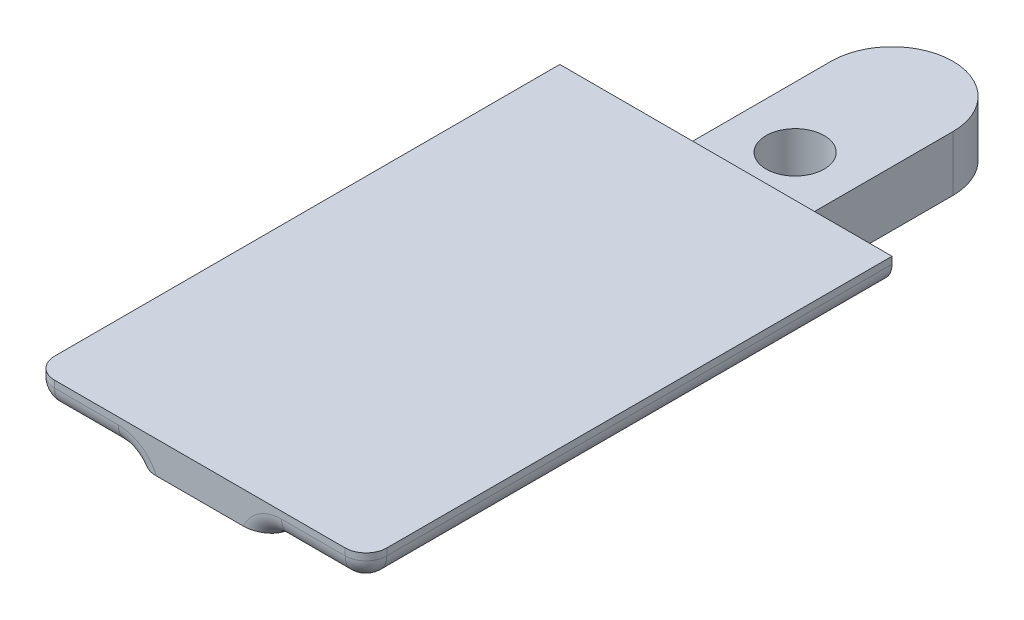
ISO-10303-21;
HEADER;
FILE_DESCRIPTION(('STEP AP214'),'2;1');
FILE_NAME('part.step','',(''),(''),'','','');
FILE_SCHEMA(('AUTOMOTIVE_DESIGN { 1 0 10303 214 1 1 1 1 }'));
ENDSEC;
DATA;
#1=APPLICATION_CONTEXT('core data for automotive mechanical design processes');
#2=APPLICATION_PROTOCOL_DEFINITION('international standard','automotive_design',2000,#1);
#3=PRODUCT_CONTEXT('',#1,'mechanical');
#4=PRODUCT('Part','Part','',(#3));
#5=PRODUCT_RELATED_PRODUCT_CATEGORY('part','',(#4));
#6=PRODUCT_DEFINITION_FORMATION('','',#4);
#7=PRODUCT_DEFINITION_CONTEXT('part definition',#1,'design');
#8=PRODUCT_DEFINITION('design','',#6,#7);
#9=PRODUCT_DEFINITION_SHAPE('','',#8);
#10=(LENGTH_UNIT() NAMED_UNIT(*) SI_UNIT(.MILLI.,.METRE.));
#11=(NAMED_UNIT(*) PLANE_ANGLE_UNIT() SI_UNIT($,.RADIAN.));
#12=(NAMED_UNIT(*) SI_UNIT($,.STERADIAN.) SOLID_ANGLE_UNIT());
#13=UNCERTAINTY_MEASURE_WITH_UNIT(LENGTH_MEASURE(1.E-05),#10,'distance_accuracy_value','');
#14=(GEOMETRIC_REPRESENTATION_CONTEXT(3) GLOBAL_UNCERTAINTY_ASSIGNED_CONTEXT((#13)) GLOBAL_UNIT_ASSIGNED_CONTEXT((#10,
#11,#12)) REPRESENTATION_CONTEXT('',''));
#15=CARTESIAN_POINT('',(0.,0.,0.));
#16=DIRECTION('',(0.,0.,1.));
#17=DIRECTION('',(1.,0.,0.));
#18=AXIS2_PLACEMENT_3D('',#15,#16,#17);
#19=CARTESIAN_POINT('',(0.,4.,-12.));
#20=DIRECTION('',(0.,1.,0.));
#21=DIRECTION('',(0.,0.,1.));
#22=AXIS2_PLACEMENT_3D('',#19,#20,#21);
#23=PLANE('',#22);
#24=DIRECTION('',(-1.,0.,0.));
#25=VECTOR('',#24,1.);
#26=CARTESIAN_POINT('',(-12.,4.,0.));
#27=LINE('',#26,#25);
#28=CARTESIAN_POINT('',(4.4,4.,0.));
#29=VERTEX_POINT('',#28);
#30=CARTESIAN_POINT('',(-4.4,4.,0.));
#31=VERTEX_POINT('',#30);
#32=EDGE_CURVE('E198',#29,#31,#27,.T.);
#33=ORIENTED_EDGE('',*,*,#32,.F.);
#34=DIRECTION('',(0.,0.,-1.));
#35=VECTOR('',#34,1.);
#36=CARTESIAN_POINT('',(4.4,4.,38.));
#37=LINE('',#36,#35);
#38=CARTESIAN_POINT('',(4.4,4.,-12.));
#39=VERTEX_POINT('',#38);
#40=EDGE_CURVE('E209',#29,#39,#37,.T.);
#41=ORIENTED_EDGE('',*,*,#40,.T.);
#42=CARTESIAN_POINT('',(0.,4.,-12.));
#43=DIRECTION('',(0.,1.,0.));
#44=DIRECTION('',(0.,0.,1.));
#45=AXIS2_PLACEMENT_3D('',#42,#43,#44);
#46=CIRCLE('',#45,4.4);
#47=CARTESIAN_POINT('',(-4.4,4.,-12.));
#48=VERTEX_POINT('',#47);
#49=EDGE_CURVE('E212',#39,#48,#46,.T.);
#50=ORIENTED_EDGE('',*,*,#49,.T.);
#51=DIRECTION('',(0.,0.,1.));
#52=VECTOR('',#51,1.);
#53=CARTESIAN_POINT('',(-4.4,4.,0.));
#54=LINE('',#53,#52);
#55=EDGE_CURVE('E206',#48,#31,#54,.T.);
#56=ORIENTED_EDGE('',*,*,#55,.T.);
#57=EDGE_LOOP('',(#33,#41,#50,#56));
#58=FACE_BOUND('',#57,.T.);
#59=CARTESIAN_POINT('',(0.,4.,-5.));
#60=DIRECTION('',(0.,1.,0.));
#61=DIRECTION('',(0.,0.,1.));
#62=AXIS2_PLACEMENT_3D('',#59,#60,#61);
#63=CIRCLE('',#62,2.1);
#64=CARTESIAN_POINT('',(0.,4.,-2.9));
#65=VERTEX_POINT('',#64);
#66=EDGE_CURVE('E200',#65,#65,#63,.T.);
#67=ORIENTED_EDGE('',*,*,#66,.F.);
#68=EDGE_LOOP('',(#67));
#69=FACE_BOUND('',#68,.T.);
#70=ADVANCED_FACE('F37',(#58,#69),#23,.T.);
#71=CARTESIAN_POINT('',(0.,0.,-12.));
#72=DIRECTION('',(0.,1.,0.));
#73=DIRECTION('',(0.,0.,1.));
#74=AXIS2_PLACEMENT_3D('',#71,#72,#73);
#75=PLANE('',#74);
#76=DIRECTION('',(0.,0.,-1.));
#77=VECTOR('',#76,1.);
#78=CARTESIAN_POINT('',(4.4,0.,0.));
#79=LINE('',#78,#77);
#80=CARTESIAN_POINT('',(4.4,0.,7.99999999999916));
#81=VERTEX_POINT('',#80);
#82=CARTESIAN_POINT('',(4.4,0.,-12.));
#83=VERTEX_POINT('',#82);
#84=EDGE_CURVE('E203',#81,#83,#79,.T.);
#85=ORIENTED_EDGE('',*,*,#84,.F.);
#86=DIRECTION('',(-1.,0.,0.));
#87=VECTOR('',#86,1.);
#88=CARTESIAN_POINT('',(0.,0.,7.99999999999916));
#89=LINE('',#88,#87);
#90=CARTESIAN_POINT('',(-4.4,0.,7.99999999999916));
#91=VERTEX_POINT('',#90);
#92=EDGE_CURVE('E231',#81,#91,#89,.T.);
#93=ORIENTED_EDGE('',*,*,#92,.T.);
#94=DIRECTION('',(0.,0.,1.));
#95=VECTOR('',#94,1.);
#96=CARTESIAN_POINT('',(-4.4,0.,0.));
#97=LINE('',#96,#95);
#98=CARTESIAN_POINT('',(-4.4,0.,-12.));
#99=VERTEX_POINT('',#98);
#100=EDGE_CURVE('E210',#99,#91,#97,.T.);
#101=ORIENTED_EDGE('',*,*,#100,.F.);
#102=CARTESIAN_POINT('',(0.,0.,-12.));
#103=DIRECTION('',(0.,1.,0.));
#104=DIRECTION('',(0.,0.,1.));
#105=AXIS2_PLACEMENT_3D('',#102,#103,#104);
#106=CIRCLE('',#105,4.4);
#107=EDGE_CURVE('E217',#83,#99,#106,.T.);
#108=ORIENTED_EDGE('',*,*,#107,.F.);
#109=EDGE_LOOP('',(#85,#93,#101,#108));
#110=FACE_BOUND('',#109,.T.);
#111=CARTESIAN_POINT('',(0.,0.,-5.));
#112=DIRECTION('',(0.,1.,0.));
#113=DIRECTION('',(0.,0.,1.));
#114=AXIS2_PLACEMENT_3D('',#111,#112,#113);
#115=CIRCLE('',#114,2.1);
#116=CARTESIAN_POINT('',(0.,0.,-2.9));
#117=VERTEX_POINT('',#116);
#118=EDGE_CURVE('E184',#117,#117,#115,.T.);
#119=ORIENTED_EDGE('',*,*,#118,.T.);
#120=EDGE_LOOP('',(#119));
#121=FACE_BOUND('',#120,.T.);
#122=ADVANCED_FACE('F329',(#110,#121),#75,.F.);
#123=CARTESIAN_POINT('',(-4.39999999999999,4.,38.));
#124=DIRECTION('',(0.,0.,-1.));
#125=DIRECTION('',(-1.,0.,0.));
#126=AXIS2_PLACEMENT_3D('',#123,#124,#125);
#127=PLANE('',#126);
#128=DIRECTION('',(1.,0.,0.));
#129=VECTOR('',#128,1.);
#130=CARTESIAN_POINT('',(-4.39999999999999,3.68353682708714,38.));
#131=LINE('',#130,#129);
#132=CARTESIAN_POINT('',(-3.1433279885107,3.68353682708714,38.));
#133=VERTEX_POINT('',#132);
#134=CARTESIAN_POINT('',(3.14332798851069,3.68353682708714,38.));
#135=VERTEX_POINT('',#134);
#136=EDGE_CURVE('E226',#133,#135,#131,.T.);
#137=ORIENTED_EDGE('',*,*,#136,.T.);
#138=CARTESIAN_POINT('',(5.9,2.5,38.));
#139=DIRECTION('',(0.,0.,-1.));
#140=DIRECTION('',(-1.,0.,0.));
#141=AXIS2_PLACEMENT_3D('',#138,#139,#140);
#142=CIRCLE('',#141,3.);
#143=CARTESIAN_POINT('',(5.9,5.5,38.));
#144=VERTEX_POINT('',#143);
#145=EDGE_CURVE('E283',#135,#144,#142,.T.);
#146=ORIENTED_EDGE('',*,*,#145,.T.);
#147=DIRECTION('',(1.,0.,0.));
#148=VECTOR('',#147,1.);
#149=CARTESIAN_POINT('',(-4.39999999999999,5.5,38.));
#150=LINE('',#149,#148);
#151=CARTESIAN_POINT('',(10.5,5.5,38.));
#152=VERTEX_POINT('',#151);
#153=EDGE_CURVE('E281',#144,#152,#150,.T.);
#154=ORIENTED_EDGE('',*,*,#153,.T.);
#155=DIRECTION('',(0.,-1.,0.));
#156=VECTOR('',#155,1.);
#157=CARTESIAN_POINT('',(10.5,4.,38.));
#158=LINE('',#157,#156);
#159=CARTESIAN_POINT('',(10.5,6.,38.));
#160=VERTEX_POINT('',#159);
#161=EDGE_CURVE('E279',#152,#160,#158,.F.);
#162=ORIENTED_EDGE('',*,*,#161,.T.);
#163=DIRECTION('',(1.,0.,0.));
#164=VECTOR('',#163,1.);
#165=CARTESIAN_POINT('',(-12.,6.,38.));
#166=LINE('',#165,#164);
#167=CARTESIAN_POINT('',(-10.5,6.,38.));
#168=VERTEX_POINT('',#167);
#169=EDGE_CURVE('E175',#168,#160,#166,.T.);
#170=ORIENTED_EDGE('',*,*,#169,.F.);
#171=DIRECTION('',(0.,-1.,0.));
#172=VECTOR('',#171,1.);
#173=CARTESIAN_POINT('',(-10.5,4.,38.));
#174=LINE('',#173,#172);
#175=CARTESIAN_POINT('',(-10.5,5.5,38.));
#176=VERTEX_POINT('',#175);
#177=EDGE_CURVE('E272',#168,#176,#174,.T.);
#178=ORIENTED_EDGE('',*,*,#177,.T.);
#179=DIRECTION('',(1.,0.,0.));
#180=VECTOR('',#179,1.);
#181=CARTESIAN_POINT('',(-4.39999999999999,5.5,38.));
#182=LINE('',#181,#180);
#183=CARTESIAN_POINT('',(-5.9,5.5,38.));
#184=VERTEX_POINT('',#183);
#185=EDGE_CURVE('E274',#176,#184,#182,.T.);
#186=ORIENTED_EDGE('',*,*,#185,.T.);
#187=CARTESIAN_POINT('',(-5.9,2.5,38.));
#188=DIRECTION('',(0.,0.,-1.));
#189=DIRECTION('',(-1.,0.,0.));
#190=AXIS2_PLACEMENT_3D('',#187,#188,#189);
#191=CIRCLE('',#190,3.);
#192=EDGE_CURVE('E276',#184,#133,#191,.T.);
#193=ORIENTED_EDGE('',*,*,#192,.T.);
#194=EDGE_LOOP('',(#137,#146,#154,#162,#170,#178,#186,#193));
#195=FACE_BOUND('',#194,.T.);
#196=ADVANCED_FACE('F335',(#195),#127,.F.);
#197=CARTESIAN_POINT('',(4.4,4.,0.));
#198=DIRECTION('',(-1.,0.,0.));
#199=DIRECTION('',(0.,0.,1.));
#200=AXIS2_PLACEMENT_3D('',#197,#198,#199);
#201=PLANE('',#200);
#202=ORIENTED_EDGE('',*,*,#40,.F.);
#203=DIRECTION('',(0.,-1.,0.));
#204=VECTOR('',#203,1.);
#205=CARTESIAN_POINT('',(4.4,6.,0.));
#206=LINE('',#205,#204);
#207=CARTESIAN_POINT('',(4.4,2.5,0.));
#208=VERTEX_POINT('',#207);
#209=EDGE_CURVE('E260',#29,#208,#206,.T.);
#210=ORIENTED_EDGE('',*,*,#209,.T.);
#211=DIRECTION('',(0.,0.,-1.));
#212=VECTOR('',#211,1.);
#213=CARTESIAN_POINT('',(4.4,2.5,38.));
#214=LINE('',#213,#212);
#215=CARTESIAN_POINT('',(4.4,2.5,28.3608660699362));
#216=VERTEX_POINT('',#215);
#217=EDGE_CURVE('E258',#208,#216,#214,.F.);
#218=ORIENTED_EDGE('',*,*,#217,.T.);
#219=DIRECTION('',(0.,0.121869343405144,0.992546151641322));
#220=VECTOR('',#219,1.);
#221=CARTESIAN_POINT('',(4.4,3.68353682708714,38.));
#222=LINE('',#221,#220);
#223=EDGE_CURVE('E229',#216,#81,#222,.F.);
#224=ORIENTED_EDGE('',*,*,#223,.T.);
#225=ORIENTED_EDGE('',*,*,#84,.T.);
#226=DIRECTION('',(0.,-1.,0.));
#227=VECTOR('',#226,1.);
#228=CARTESIAN_POINT('',(4.4,4.,-12.));
#229=LINE('',#228,#227);
#230=EDGE_CURVE('E223',#39,#83,#229,.T.);
#231=ORIENTED_EDGE('',*,*,#230,.F.);
#232=EDGE_LOOP('',(#202,#210,#218,#224,#225,#231));
#233=FACE_BOUND('',#232,.T.);
#234=ADVANCED_FACE('F351',(#233),#201,.F.);
#235=CARTESIAN_POINT('',(0.,4.,-12.));
#236=DIRECTION('',(0.,-1.,0.));
#237=DIRECTION('',(0.,0.,-1.));
#238=AXIS2_PLACEMENT_3D('',#235,#236,#237);
#239=CYLINDRICAL_SURFACE('',#238,4.4);
#240=ORIENTED_EDGE('',*,*,#107,.T.);
#241=DIRECTION('',(0.,-1.,0.));
#242=VECTOR('',#241,1.);
#243=CARTESIAN_POINT('',(-4.4,4.,-12.));
#244=LINE('',#243,#242);
#245=EDGE_CURVE('E215',#48,#99,#244,.T.);
#246=ORIENTED_EDGE('',*,*,#245,.F.);
#247=ORIENTED_EDGE('',*,*,#49,.F.);
#248=ORIENTED_EDGE('',*,*,#230,.T.);
#249=EDGE_LOOP('',(#240,#246,#247,#248));
#250=FACE_BOUND('',#249,.T.);
#251=ADVANCED_FACE('F347',(#250),#239,.T.);
#252=CARTESIAN_POINT('',(-4.4,4.,0.));
#253=DIRECTION('',(1.,0.,0.));
#254=DIRECTION('',(0.,0.,-1.));
#255=AXIS2_PLACEMENT_3D('',#252,#253,#254);
#256=PLANE('',#255);
#257=DIRECTION('',(0.,-0.121869343405144,-0.992546151641322));
#258=VECTOR('',#257,1.);
#259=CARTESIAN_POINT('',(-4.39999999999999,3.68353682708714,38.));
#260=LINE('',#259,#258);
#261=CARTESIAN_POINT('',(-4.4,2.5,28.3608660699361));
#262=VERTEX_POINT('',#261);
#263=EDGE_CURVE('E233',#91,#262,#260,.F.);
#264=ORIENTED_EDGE('',*,*,#263,.T.);
#265=DIRECTION('',(0.,0.,1.));
#266=VECTOR('',#265,1.);
#267=CARTESIAN_POINT('',(-4.4,2.5,0.));
#268=LINE('',#267,#266);
#269=CARTESIAN_POINT('',(-4.4,2.5,0.));
#270=VERTEX_POINT('',#269);
#271=EDGE_CURVE('E255',#262,#270,#268,.F.);
#272=ORIENTED_EDGE('',*,*,#271,.T.);
#273=DIRECTION('',(0.,1.,0.));
#274=VECTOR('',#273,1.);
#275=CARTESIAN_POINT('',(-4.4,6.,0.));
#276=LINE('',#275,#274);
#277=EDGE_CURVE('E253',#270,#31,#276,.T.);
#278=ORIENTED_EDGE('',*,*,#277,.T.);
#279=ORIENTED_EDGE('',*,*,#55,.F.);
#280=ORIENTED_EDGE('',*,*,#245,.T.);
#281=ORIENTED_EDGE('',*,*,#100,.T.);
#282=EDGE_LOOP('',(#264,#272,#278,#279,#280,#281));
#283=FACE_BOUND('',#282,.T.);
#284=ADVANCED_FACE('F344',(#283),#256,.F.);
#285=CARTESIAN_POINT('',(0.,4.,-5.));
#286=DIRECTION('',(0.,-1.,0.));
#287=DIRECTION('',(0.,0.,-1.));
#288=AXIS2_PLACEMENT_3D('',#285,#286,#287);
#289=CYLINDRICAL_SURFACE('',#288,2.1);
#290=ORIENTED_EDGE('',*,*,#66,.T.);
#291=EDGE_LOOP('',(#290));
#292=FACE_BOUND('',#291,.T.);
#293=ORIENTED_EDGE('',*,*,#118,.F.);
#294=EDGE_LOOP('',(#293));
#295=FACE_BOUND('',#294,.T.);
#296=ADVANCED_FACE('F341',(#292,#295),#289,.F.);
#297=CARTESIAN_POINT('',(0.,4.,0.));
#298=DIRECTION('',(0.,1.,0.));
#299=DIRECTION('',(0.,0.,1.));
#300=AXIS2_PLACEMENT_3D('',#297,#298,#299);
#301=PLANE('',#300);
#302=DIRECTION('',(0.,0.,1.));
#303=VECTOR('',#302,1.);
#304=CARTESIAN_POINT('',(-5.9,4.,38.));
#305=LINE('',#304,#303);
#306=CARTESIAN_POINT('',(-5.9,4.,0.));
#307=VERTEX_POINT('',#306);
#308=CARTESIAN_POINT('',(-5.9,4.,36.5));
#309=VERTEX_POINT('',#308);
#310=EDGE_CURVE('E238',#307,#309,#305,.T.);
#311=ORIENTED_EDGE('',*,*,#310,.T.);
#312=DIRECTION('',(1.,0.,0.));
#313=VECTOR('',#312,1.);
#314=CARTESIAN_POINT('',(0.,4.,36.5));
#315=LINE('',#314,#313);
#316=CARTESIAN_POINT('',(-10.5,4.,36.5));
#317=VERTEX_POINT('',#316);
#318=EDGE_CURVE('E408',#309,#317,#315,.F.);
#319=ORIENTED_EDGE('',*,*,#318,.T.);
#320=DIRECTION('',(0.,0.,1.));
#321=VECTOR('',#320,1.);
#322=CARTESIAN_POINT('',(-10.5,4.,0.));
#323=LINE('',#322,#321);
#324=CARTESIAN_POINT('',(-10.5,4.,0.));
#325=VERTEX_POINT('',#324);
#326=EDGE_CURVE('E241',#317,#325,#323,.F.);
#327=ORIENTED_EDGE('',*,*,#326,.T.);
#328=EDGE_CURVE('E197',#307,#325,#27,.T.);
#329=ORIENTED_EDGE('',*,*,#328,.F.);
#330=EDGE_LOOP('',(#311,#319,#327,#329));
#331=FACE_BOUND('',#330,.T.);
#332=ADVANCED_FACE('F510',(#331),#301,.F.);
#333=DIRECTION('',(0.,0.,-1.));
#334=VECTOR('',#333,1.);
#335=CARTESIAN_POINT('',(10.5,4.,0.));
#336=LINE('',#335,#334);
#337=CARTESIAN_POINT('',(10.5,4.,0.));
#338=VERTEX_POINT('',#337);
#339=CARTESIAN_POINT('',(10.5,4.,36.5));
#340=VERTEX_POINT('',#339);
#341=EDGE_CURVE('E250',#338,#340,#336,.F.);
#342=ORIENTED_EDGE('',*,*,#341,.T.);
#343=DIRECTION('',(1.,0.,0.));
#344=VECTOR('',#343,1.);
#345=CARTESIAN_POINT('',(0.,4.,36.5));
#346=LINE('',#345,#344);
#347=CARTESIAN_POINT('',(5.9,4.,36.5));
#348=VERTEX_POINT('',#347);
#349=EDGE_CURVE('E412',#340,#348,#346,.F.);
#350=ORIENTED_EDGE('',*,*,#349,.T.);
#351=DIRECTION('',(0.,0.,-1.));
#352=VECTOR('',#351,1.);
#353=CARTESIAN_POINT('',(5.9,4.,0.));
#354=LINE('',#353,#352);
#355=CARTESIAN_POINT('',(5.9,4.,0.));
#356=VERTEX_POINT('',#355);
#357=EDGE_CURVE('E248',#348,#356,#354,.T.);
#358=ORIENTED_EDGE('',*,*,#357,.T.);
#359=EDGE_CURVE('E194',#338,#356,#27,.T.);
#360=ORIENTED_EDGE('',*,*,#359,.F.);
#361=EDGE_LOOP('',(#342,#350,#358,#360));
#362=FACE_BOUND('',#361,.T.);
#363=ADVANCED_FACE('F423',(#362),#301,.F.);
#364=CARTESIAN_POINT('',(-12.,6.,0.));
#365=DIRECTION('',(1.,0.,0.));
#366=DIRECTION('',(0.,0.,-1.));
#367=AXIS2_PLACEMENT_3D('',#364,#365,#366);
#368=PLANE('',#367);
#369=DIRECTION('',(0.,0.,1.));
#370=VECTOR('',#369,1.);
#371=CARTESIAN_POINT('',(-12.,5.5,0.));
#372=LINE('',#371,#370);
#373=CARTESIAN_POINT('',(-12.,5.5,0.));
#374=VERTEX_POINT('',#373);
#375=CARTESIAN_POINT('',(-12.,5.5,36.5));
#376=VERTEX_POINT('',#375);
#377=EDGE_CURVE('E236',#374,#376,#372,.T.);
#378=ORIENTED_EDGE('',*,*,#377,.T.);
#379=DIRECTION('',(0.,-1.,0.));
#380=VECTOR('',#379,1.);
#381=CARTESIAN_POINT('',(-12.,6.,36.5));
#382=LINE('',#381,#380);
#383=CARTESIAN_POINT('',(-12.,6.,36.5));
#384=VERTEX_POINT('',#383);
#385=EDGE_CURVE('E11',#376,#384,#382,.F.);
#386=ORIENTED_EDGE('',*,*,#385,.T.);
#387=DIRECTION('',(0.,0.,1.));
#388=VECTOR('',#387,1.);
#389=CARTESIAN_POINT('',(-12.,6.,0.));
#390=LINE('',#389,#388);
#391=CARTESIAN_POINT('',(-12.,6.,0.));
#392=VERTEX_POINT('',#391);
#393=EDGE_CURVE('E196',#392,#384,#390,.T.);
#394=ORIENTED_EDGE('',*,*,#393,.F.);
#395=DIRECTION('',(0.,-1.,0.));
#396=VECTOR('',#395,1.);
#397=CARTESIAN_POINT('',(-12.,6.,0.));
#398=LINE('',#397,#396);
#399=EDGE_CURVE('E185',#392,#374,#398,.T.);
#400=ORIENTED_EDGE('',*,*,#399,.T.);
#401=EDGE_LOOP('',(#378,#386,#394,#400));
#402=FACE_BOUND('',#401,.T.);
#403=ADVANCED_FACE('F494',(#402),#368,.F.);
#404=CARTESIAN_POINT('',(12.,6.,0.));
#405=DIRECTION('',(-1.,0.,0.));
#406=DIRECTION('',(0.,0.,1.));
#407=AXIS2_PLACEMENT_3D('',#404,#405,#406);
#408=PLANE('',#407);
#409=DIRECTION('',(0.,0.,-1.));
#410=VECTOR('',#409,1.);
#411=CARTESIAN_POINT('',(12.,6.,0.));
#412=LINE('',#411,#410);
#413=CARTESIAN_POINT('',(12.,6.,36.5));
#414=VERTEX_POINT('',#413);
#415=CARTESIAN_POINT('',(12.,6.,0.));
#416=VERTEX_POINT('',#415);
#417=EDGE_CURVE('E167',#414,#416,#412,.T.);
#418=ORIENTED_EDGE('',*,*,#417,.F.);
#419=DIRECTION('',(0.,-1.,0.));
#420=VECTOR('',#419,1.);
#421=CARTESIAN_POINT('',(12.,6.,36.5));
#422=LINE('',#421,#420);
#423=CARTESIAN_POINT('',(12.,5.5,36.5));
#424=VERTEX_POINT('',#423);
#425=EDGE_CURVE('E402',#414,#424,#422,.T.);
#426=ORIENTED_EDGE('',*,*,#425,.T.);
#427=DIRECTION('',(0.,0.,-1.));
#428=VECTOR('',#427,1.);
#429=CARTESIAN_POINT('',(12.,5.5,0.));
#430=LINE('',#429,#428);
#431=CARTESIAN_POINT('',(12.,5.5,0.));
#432=VERTEX_POINT('',#431);
#433=EDGE_CURVE('E181',#424,#432,#430,.T.);
#434=ORIENTED_EDGE('',*,*,#433,.T.);
#435=DIRECTION('',(0.,-1.,0.));
#436=VECTOR('',#435,1.);
#437=CARTESIAN_POINT('',(12.,6.,0.));
#438=LINE('',#437,#436);
#439=EDGE_CURVE('E178',#416,#432,#438,.T.);
#440=ORIENTED_EDGE('',*,*,#439,.F.);
#441=EDGE_LOOP('',(#418,#426,#434,#440));
#442=FACE_BOUND('',#441,.T.);
#443=ADVANCED_FACE('F179',(#442),#408,.F.);
#444=CARTESIAN_POINT('',(-12.,6.,0.));
#445=DIRECTION('',(0.,0.,1.));
#446=DIRECTION('',(1.,0.,0.));
#447=AXIS2_PLACEMENT_3D('',#444,#445,#446);
#448=PLANE('',#447);
#449=ORIENTED_EDGE('',*,*,#328,.T.);
#450=CARTESIAN_POINT('',(-10.5,5.5,0.));
#451=DIRECTION('',(0.,0.,1.));
#452=DIRECTION('',(1.,0.,0.));
#453=AXIS2_PLACEMENT_3D('',#450,#451,#452);
#454=CIRCLE('',#453,1.5);
#455=EDGE_CURVE('E245',#325,#374,#454,.F.);
#456=ORIENTED_EDGE('',*,*,#455,.T.);
#457=ORIENTED_EDGE('',*,*,#399,.F.);
#458=DIRECTION('',(-1.,0.,0.));
#459=VECTOR('',#458,1.);
#460=CARTESIAN_POINT('',(-12.,6.,0.));
#461=LINE('',#460,#459);
#462=EDGE_CURVE('E171',#416,#392,#461,.T.);
#463=ORIENTED_EDGE('',*,*,#462,.F.);
#464=ORIENTED_EDGE('',*,*,#439,.T.);
#465=CARTESIAN_POINT('',(10.5,5.5,0.));
#466=DIRECTION('',(0.,0.,1.));
#467=DIRECTION('',(1.,0.,0.));
#468=AXIS2_PLACEMENT_3D('',#465,#466,#467);
#469=CIRCLE('',#468,1.5);
#470=EDGE_CURVE('E243',#432,#338,#469,.F.);
#471=ORIENTED_EDGE('',*,*,#470,.T.);
#472=ORIENTED_EDGE('',*,*,#359,.T.);
#473=CARTESIAN_POINT('',(5.9,2.5,0.));
#474=DIRECTION('',(0.,0.,1.));
#475=DIRECTION('',(1.,0.,0.));
#476=AXIS2_PLACEMENT_3D('',#473,#474,#475);
#477=CIRCLE('',#476,1.5);
#478=EDGE_CURVE('E267',#356,#208,#477,.T.);
#479=ORIENTED_EDGE('',*,*,#478,.T.);
#480=ORIENTED_EDGE('',*,*,#209,.F.);
#481=ORIENTED_EDGE('',*,*,#32,.T.);
#482=ORIENTED_EDGE('',*,*,#277,.F.);
#483=CARTESIAN_POINT('',(-5.9,2.5,0.));
#484=DIRECTION('',(0.,0.,1.));
#485=DIRECTION('',(1.,0.,0.));
#486=AXIS2_PLACEMENT_3D('',#483,#484,#485);
#487=CIRCLE('',#486,1.5);
#488=EDGE_CURVE('E265',#270,#307,#487,.T.);
#489=ORIENTED_EDGE('',*,*,#488,.T.);
#490=EDGE_LOOP('',(#449,#456,#457,#463,#464,#471,#472,#479,#480,#481,#482,#489));
#491=FACE_BOUND('',#490,.T.);
#492=ADVANCED_FACE('F188',(#491),#448,.F.);
#493=CARTESIAN_POINT('',(0.,6.,0.));
#494=DIRECTION('',(0.,1.,0.));
#495=DIRECTION('',(0.,0.,1.));
#496=AXIS2_PLACEMENT_3D('',#493,#494,#495);
#497=PLANE('',#496);
#498=ORIENTED_EDGE('',*,*,#169,.T.);
#499=CARTESIAN_POINT('',(10.5,6.,36.5));
#500=DIRECTION('',(0.,1.,0.));
#501=DIRECTION('',(0.,0.,1.));
#502=AXIS2_PLACEMENT_3D('',#499,#500,#501);
#503=CIRCLE('',#502,1.5);
#504=EDGE_CURVE('E46',#160,#414,#503,.T.);
#505=ORIENTED_EDGE('',*,*,#504,.T.);
#506=ORIENTED_EDGE('',*,*,#417,.T.);
#507=ORIENTED_EDGE('',*,*,#462,.T.);
#508=ORIENTED_EDGE('',*,*,#393,.T.);
#509=CARTESIAN_POINT('',(-10.5,6.,36.5));
#510=DIRECTION('',(0.,1.,0.));
#511=DIRECTION('',(0.,0.,1.));
#512=AXIS2_PLACEMENT_3D('',#509,#510,#511);
#513=CIRCLE('',#512,1.5);
#514=EDGE_CURVE('E401',#384,#168,#513,.T.);
#515=ORIENTED_EDGE('',*,*,#514,.T.);
#516=EDGE_LOOP('',(#498,#505,#506,#507,#508,#515));
#517=FACE_BOUND('',#516,.T.);
#518=ADVANCED_FACE('F169',(#517),#497,.T.);
#519=CARTESIAN_POINT('',(-4.39999999999999,3.68353682708714,38.));
#520=DIRECTION('',(0.,0.992546151641322,-0.121869343405144));
#521=DIRECTION('',(1.,0.,0.));
#522=AXIS2_PLACEMENT_3D('',#519,#520,#521);
#523=PLANE('',#522);
#524=CARTESIAN_POINT('',(5.9,2.5,28.3608660699362));
#525=DIRECTION('',(0.,0.992546151641322,-0.121869343405144));
#526=DIRECTION('',(0.,0.121869343405144,0.992546151641322));
#527=AXIS2_PLACEMENT_3D('',#524,#525,#526);
#528=ELLIPSE('',#527,12.3082635721879,1.5);
#529=CARTESIAN_POINT('',(4.78139389465453,3.49935998573279,36.5));
#530=VERTEX_POINT('',#529);
#531=EDGE_CURVE('E269',#216,#530,#528,.T.);
#532=ORIENTED_EDGE('',*,*,#531,.T.);
#533=CARTESIAN_POINT('',(4.78139389465453,3.49935998573279,36.5));
#534=CARTESIAN_POINT('',(4.78496977737218,3.50334767368029,36.5324771120911));
#535=CARTESIAN_POINT('',(4.7871609310079,3.50735476545456,36.5651122556694));
#536=CARTESIAN_POINT('',(4.78868050838891,3.51537722421931,36.6304499390537));
#537=CARTESIAN_POINT('',(4.78800866373264,3.51939259195037,36.6631524848911));
#538=CARTESIAN_POINT('',(4.78372396577851,3.52737107892938,36.7281320468193));
#539=CARTESIAN_POINT('',(4.78013262044762,3.53133436560625,36.7604104265091));
#540=CARTESIAN_POINT('',(4.77006144678659,3.5392043940065,36.8245066641987));
#541=CARTESIAN_POINT('',(4.76358201422063,3.54311114340165,36.8563245846801));
#542=CARTESIAN_POINT('',(4.73991654450427,3.55470882255518,36.950780101467));
#543=CARTESIAN_POINT('',(4.7185033806437,3.56227710222765,37.0124187929834));
#544=CARTESIAN_POINT('',(4.66589759883707,3.57689250142264,37.1314516672106));
#545=CARTESIAN_POINT('',(4.6346865173637,3.58393860569499,37.1888375813722));
#546=CARTESIAN_POINT('',(4.55407915567189,3.59935226986509,37.3143718020979));
#547=CARTESIAN_POINT('',(4.50203416687803,3.6075138320277,37.3808423917436));
#548=CARTESIAN_POINT('',(4.38779502884227,3.62269990840536,37.504523058645));
#549=CARTESIAN_POINT('',(4.32558824837396,3.62972298554318,37.5617214318458));
#550=CARTESIAN_POINT('',(4.192386957455,3.64266090188707,37.6670923046066));
#551=CARTESIAN_POINT('',(4.12127759378791,3.64855809911662,37.7151211217981));
#552=CARTESIAN_POINT('',(3.97287462971822,3.65904982650971,37.8005693843153));
#553=CARTESIAN_POINT('',(3.89557997748404,3.66364413450586,37.8379870202328));
#554=CARTESIAN_POINT('',(3.72341810110262,3.67209937243527,37.9068494070609));
#555=CARTESIAN_POINT('',(3.62774358481664,3.67571770564447,37.9363183662085));
#556=CARTESIAN_POINT('',(3.4329295675328,3.68097916583566,37.9791695207225));
#557=CARTESIAN_POINT('',(3.33379679503648,3.68262592985641,37.9925813373926));
#558=CARTESIAN_POINT('',(3.204018930062,3.68344165817373,37.9992249113999));
#559=CARTESIAN_POINT('',(3.17366735511932,3.68353728915816,38.0000037632664));
#560=CARTESIAN_POINT('',(3.1433279885107,3.68353682708714,38.));
#561=B_SPLINE_CURVE_WITH_KNOTS('',3,(#533,#534,#535,#536,#537,#538,#539,#540,#541,#542,#543,
#544,#545,#546,#547,#548,#549,#550,#551,#552,#553,#554,#555,#556,#557,#558,#559,#560),
.UNSPECIFIED.,.F.,.F.,(4,2,2,2,2,2,2,2,2,2,2,2,2,4),(0.,0.0987298448379645,0.197468945646413,
0.295487157283393,0.39349194128686,0.58950348072477,0.785886630933311,1.0389817115367,
1.29239382022462,1.54949892632654,1.80664784741194,2.10582603344009,2.40445145794675,
2.49549409686866),.UNSPECIFIED.);
#562=EDGE_CURVE('E296',#530,#135,#561,.T.);
#563=ORIENTED_EDGE('',*,*,#562,.T.);
#564=ORIENTED_EDGE('',*,*,#136,.F.);
#565=CARTESIAN_POINT('',(-3.1433279885107,3.68353682708714,38.));
#566=CARTESIAN_POINT('',(-3.19400048013639,3.68353668798516,37.9999988671052));
#567=CARTESIAN_POINT('',(-3.24464467440604,3.68327049921482,37.9978309335443));
#568=CARTESIAN_POINT('',(-3.34555570327887,3.6822144483694,37.9892300896137));
#569=CARTESIAN_POINT('',(-3.39582260279337,3.68142467856344,37.9827979307157));
#570=CARTESIAN_POINT('',(-3.5455255993038,3.6782841178414,37.9572201162172));
#571=CARTESIAN_POINT('',(-3.64394373533433,3.67516204873747,37.9317929038628));
#572=CARTESIAN_POINT('',(-3.8350838532526,3.66697280712571,37.8650968831942));
#573=CARTESIAN_POINT('',(-3.92780683294224,3.6619059764778,37.8238308591058));
#574=CARTESIAN_POINT('',(-4.1050069267337,3.64994047176553,37.7263796435435));
#575=CARTESIAN_POINT('',(-4.18948399325438,3.64304178713174,37.6701943659885));
#576=CARTESIAN_POINT('',(-4.33331503500569,3.62888004614308,37.5548562413536));
#577=CARTESIAN_POINT('',(-4.39448205887206,3.62188973328815,37.4979247118231));
#578=CARTESIAN_POINT('',(-4.50675603178686,3.60679929309722,37.3750229391576));
#579=CARTESIAN_POINT('',(-4.55787990254511,3.5987010722285,37.3090682229525));
#580=CARTESIAN_POINT('',(-4.63801914572261,3.58323635037338,37.1831181707521));
#581=CARTESIAN_POINT('',(-4.66941492427968,3.57605345278008,37.1246181643956));
#582=CARTESIAN_POINT('',(-4.7219894647219,3.56115211187138,37.0032564817938));
#583=CARTESIAN_POINT('',(-4.74318629366141,3.55343464348843,36.9404027457361));
#584=CARTESIAN_POINT('',(-4.76584432927495,3.5417965112881,36.8456177653221));
#585=CARTESIAN_POINT('',(-4.77182972352661,3.5380003592766,36.8147005882471));
#586=CARTESIAN_POINT('',(-4.78107992594887,3.53035769685862,36.752456097883));
#587=CARTESIAN_POINT('',(-4.78434446651274,3.5265111815365,36.7211287445592));
#588=CARTESIAN_POINT('',(-4.78814776318389,3.51877330714695,36.6581088149145));
#589=CARTESIAN_POINT('',(-4.78866842958511,3.51488181957452,36.6264151920045));
#590=CARTESIAN_POINT('',(-4.78702349487078,3.50710750000033,36.5630984401505));
#591=CARTESIAN_POINT('',(-4.78485813853847,3.50322466724214,36.5314753050459));
#592=CARTESIAN_POINT('',(-4.78139389465453,3.49935998573279,36.5));
#593=B_SPLINE_CURVE_WITH_KNOTS('',3,(#565,#566,#567,#568,#569,#570,#571,#572,#573,#574,#575,
#576,#577,#578,#579,#580,#581,#582,#583,#584,#585,#586,#587,#588,#589,#590,#591,#592),
.UNSPECIFIED.,.F.,.F.,(4,2,2,2,2,2,2,2,2,2,2,2,2,4),(0.,0.151916557124428,0.303806349564124,
0.607349773523092,0.91083986351747,1.21433170462787,1.46496349712341,1.71516930828996,
1.91473801041236,2.11395187050148,2.2090100103579,2.30407749845573,2.39977096673977,
2.49545571490514),.UNSPECIFIED.);
#594=CARTESIAN_POINT('',(-4.78139389465453,3.49935998573279,36.5));
#595=VERTEX_POINT('',#594);
#596=EDGE_CURVE('E288',#133,#595,#593,.T.);
#597=ORIENTED_EDGE('',*,*,#596,.T.);
#598=CARTESIAN_POINT('',(-5.9,2.5,28.3608660699362));
#599=DIRECTION('',(0.,0.992546151641322,-0.121869343405144));
#600=DIRECTION('',(0.,-0.121869343405144,-0.992546151641322));
#601=AXIS2_PLACEMENT_3D('',#598,#599,#600);
#602=ELLIPSE('',#601,12.3082635721879,1.5);
#603=EDGE_CURVE('E263',#595,#262,#602,.T.);
#604=ORIENTED_EDGE('',*,*,#603,.T.);
#605=ORIENTED_EDGE('',*,*,#263,.F.);
#606=ORIENTED_EDGE('',*,*,#92,.F.);
#607=ORIENTED_EDGE('',*,*,#223,.F.);
#608=EDGE_LOOP('',(#532,#563,#564,#597,#604,#605,#606,#607));
#609=FACE_BOUND('',#608,.T.);
#610=ADVANCED_FACE('F304',(#609),#523,.F.);
#611=CARTESIAN_POINT('',(-10.5,5.5,0.));
#612=DIRECTION('',(0.,0.,1.));
#613=DIRECTION('',(1.,0.,0.));
#614=AXIS2_PLACEMENT_3D('',#611,#612,#613);
#615=CYLINDRICAL_SURFACE('',#614,1.5);
#616=ORIENTED_EDGE('',*,*,#326,.F.);
#617=CARTESIAN_POINT('',(-10.5,5.5,36.5));
#618=DIRECTION('',(0.,0.,1.));
#619=DIRECTION('',(1.,0.,0.));
#620=AXIS2_PLACEMENT_3D('',#617,#618,#619);
#621=CIRCLE('',#620,1.5);
#622=EDGE_CURVE('E398',#317,#376,#621,.F.);
#623=ORIENTED_EDGE('',*,*,#622,.T.);
#624=ORIENTED_EDGE('',*,*,#377,.F.);
#625=ORIENTED_EDGE('',*,*,#455,.F.);
#626=EDGE_LOOP('',(#616,#623,#624,#625));
#627=FACE_BOUND('',#626,.T.);
#628=ADVANCED_FACE('F429',(#627),#615,.T.);
#629=CARTESIAN_POINT('',(10.5,5.5,0.));
#630=DIRECTION('',(0.,0.,-1.));
#631=DIRECTION('',(-1.,0.,0.));
#632=AXIS2_PLACEMENT_3D('',#629,#630,#631);
#633=CYLINDRICAL_SURFACE('',#632,1.5);
#634=ORIENTED_EDGE('',*,*,#433,.F.);
#635=CARTESIAN_POINT('',(10.5,5.5,36.5));
#636=DIRECTION('',(0.,0.,-1.));
#637=DIRECTION('',(-1.,0.,0.));
#638=AXIS2_PLACEMENT_3D('',#635,#636,#637);
#639=CIRCLE('',#638,1.5);
#640=EDGE_CURVE('E385',#424,#340,#639,.T.);
#641=ORIENTED_EDGE('',*,*,#640,.T.);
#642=ORIENTED_EDGE('',*,*,#341,.F.);
#643=ORIENTED_EDGE('',*,*,#470,.F.);
#644=EDGE_LOOP('',(#634,#641,#642,#643));
#645=FACE_BOUND('',#644,.T.);
#646=ADVANCED_FACE('F426',(#645),#633,.T.);
#647=CARTESIAN_POINT('',(-5.9,2.5,0.));
#648=DIRECTION('',(0.,0.,-1.));
#649=DIRECTION('',(-1.,0.,0.));
#650=AXIS2_PLACEMENT_3D('',#647,#648,#649);
#651=CYLINDRICAL_SURFACE('',#650,1.5);
#652=ORIENTED_EDGE('',*,*,#603,.F.);
#653=CARTESIAN_POINT('',(-5.9,2.5,36.5));
#654=DIRECTION('',(0.,0.,-1.));
#655=DIRECTION('',(-1.,0.,0.));
#656=AXIS2_PLACEMENT_3D('',#653,#654,#655);
#657=CIRCLE('',#656,1.5);
#658=EDGE_CURVE('E410',#595,#309,#657,.F.);
#659=ORIENTED_EDGE('',*,*,#658,.T.);
#660=ORIENTED_EDGE('',*,*,#310,.F.);
#661=ORIENTED_EDGE('',*,*,#488,.F.);
#662=ORIENTED_EDGE('',*,*,#271,.F.);
#663=EDGE_LOOP('',(#652,#659,#660,#661,#662));
#664=FACE_BOUND('',#663,.T.);
#665=ADVANCED_FACE('F428',(#664),#651,.F.);
#666=CARTESIAN_POINT('',(5.9,2.5,0.));
#667=DIRECTION('',(0.,0.,1.));
#668=DIRECTION('',(1.,0.,0.));
#669=AXIS2_PLACEMENT_3D('',#666,#667,#668);
#670=CYLINDRICAL_SURFACE('',#669,1.5);
#671=ORIENTED_EDGE('',*,*,#357,.F.);
#672=CARTESIAN_POINT('',(5.9,2.5,36.5));
#673=DIRECTION('',(0.,0.,-1.));
#674=DIRECTION('',(-1.,0.,0.));
#675=AXIS2_PLACEMENT_3D('',#672,#673,#674);
#676=CIRCLE('',#675,1.5);
#677=EDGE_CURVE('E286',#348,#530,#676,.F.);
#678=ORIENTED_EDGE('',*,*,#677,.T.);
#679=ORIENTED_EDGE('',*,*,#531,.F.);
#680=ORIENTED_EDGE('',*,*,#217,.F.);
#681=ORIENTED_EDGE('',*,*,#478,.F.);
#682=EDGE_LOOP('',(#671,#678,#679,#680,#681));
#683=FACE_BOUND('',#682,.T.);
#684=ADVANCED_FACE('F420',(#683),#670,.F.);
#685=CARTESIAN_POINT('',(10.5,6.,36.5));
#686=DIRECTION('',(0.,-1.,0.));
#687=DIRECTION('',(0.,0.,-1.));
#688=AXIS2_PLACEMENT_3D('',#685,#686,#687);
#689=CYLINDRICAL_SURFACE('',#688,1.5);
#690=CARTESIAN_POINT('',(10.5,5.5,36.5));
#691=DIRECTION('',(0.,-1.,0.));
#692=DIRECTION('',(0.,0.,-1.));
#693=AXIS2_PLACEMENT_3D('',#690,#691,#692);
#694=CIRCLE('',#693,1.5);
#695=EDGE_CURVE('E381',#424,#152,#694,.T.);
#696=ORIENTED_EDGE('',*,*,#695,.F.);
#697=ORIENTED_EDGE('',*,*,#425,.F.);
#698=ORIENTED_EDGE('',*,*,#504,.F.);
#699=ORIENTED_EDGE('',*,*,#161,.F.);
#700=EDGE_LOOP('',(#696,#697,#698,#699));
#701=FACE_BOUND('',#700,.T.);
#702=ADVANCED_FACE('F315',(#701),#689,.T.);
#703=CARTESIAN_POINT('',(10.5,5.5,36.5));
#704=DIRECTION('',(0.,0.,-1.));
#705=DIRECTION('',(-1.,0.,0.));
#706=AXIS2_PLACEMENT_3D('',#703,#704,#705);
#707=SPHERICAL_SURFACE('',#706,1.5);
#708=ORIENTED_EDGE('',*,*,#640,.F.);
#709=ORIENTED_EDGE('',*,*,#695,.T.);
#710=CARTESIAN_POINT('',(10.5,5.5,36.5));
#711=DIRECTION('',(-1.,0.,0.));
#712=DIRECTION('',(0.,0.,1.));
#713=AXIS2_PLACEMENT_3D('',#710,#711,#712);
#714=CIRCLE('',#713,1.5);
#715=EDGE_CURVE('E371',#340,#152,#714,.T.);
#716=ORIENTED_EDGE('',*,*,#715,.F.);
#717=EDGE_LOOP('',(#708,#709,#716));
#718=FACE_BOUND('',#717,.T.);
#719=ADVANCED_FACE('F384',(#718),#707,.T.);
#720=CARTESIAN_POINT('',(-4.39999999999999,5.5,36.5));
#721=DIRECTION('',(1.,0.,0.));
#722=DIRECTION('',(0.,0.,-1.));
#723=AXIS2_PLACEMENT_3D('',#720,#721,#722);
#724=CYLINDRICAL_SURFACE('',#723,1.5);
#725=ORIENTED_EDGE('',*,*,#715,.T.);
#726=ORIENTED_EDGE('',*,*,#153,.F.);
#727=CARTESIAN_POINT('',(5.9,5.5,36.5));
#728=DIRECTION('',(-1.,0.,0.));
#729=DIRECTION('',(0.,0.,1.));
#730=AXIS2_PLACEMENT_3D('',#727,#728,#729);
#731=CIRCLE('',#730,1.5);
#732=EDGE_CURVE('E367',#348,#144,#731,.T.);
#733=ORIENTED_EDGE('',*,*,#732,.F.);
#734=ORIENTED_EDGE('',*,*,#349,.F.);
#735=EDGE_LOOP('',(#725,#726,#733,#734));
#736=FACE_BOUND('',#735,.T.);
#737=ADVANCED_FACE('F374',(#736),#724,.T.);
#738=CARTESIAN_POINT('',(5.9,2.5,36.5));
#739=DIRECTION('',(0.,0.,-1.));
#740=DIRECTION('',(-1.,0.,0.));
#741=AXIS2_PLACEMENT_3D('',#738,#739,#740);
#742=TOROIDAL_SURFACE('',#741,3.,1.5);
#743=ORIENTED_EDGE('',*,*,#562,.F.);
#744=ORIENTED_EDGE('',*,*,#677,.F.);
#745=ORIENTED_EDGE('',*,*,#732,.T.);
#746=ORIENTED_EDGE('',*,*,#145,.F.);
#747=EDGE_LOOP('',(#743,#744,#745,#746));
#748=FACE_BOUND('',#747,.T.);
#749=ADVANCED_FACE('F325',(#748),#742,.T.);
#750=CARTESIAN_POINT('',(-10.5,4.,36.5));
#751=DIRECTION('',(0.,-1.,0.));
#752=DIRECTION('',(0.,0.,-1.));
#753=AXIS2_PLACEMENT_3D('',#750,#751,#752);
#754=CYLINDRICAL_SURFACE('',#753,1.5);
#755=ORIENTED_EDGE('',*,*,#514,.F.);
#756=ORIENTED_EDGE('',*,*,#385,.F.);
#757=CARTESIAN_POINT('',(-10.5,5.5,36.5));
#758=DIRECTION('',(0.,-1.,0.));
#759=DIRECTION('',(0.,0.,-1.));
#760=AXIS2_PLACEMENT_3D('',#757,#758,#759);
#761=CIRCLE('',#760,1.5);
#762=EDGE_CURVE('E41',#176,#376,#761,.T.);
#763=ORIENTED_EDGE('',*,*,#762,.F.);
#764=ORIENTED_EDGE('',*,*,#177,.F.);
#765=EDGE_LOOP('',(#755,#756,#763,#764));
#766=FACE_BOUND('',#765,.T.);
#767=ADVANCED_FACE('F39',(#766),#754,.T.);
#768=CARTESIAN_POINT('',(-10.5,5.5,36.5));
#769=DIRECTION('',(0.,0.,-1.));
#770=DIRECTION('',(-1.,0.,0.));
#771=AXIS2_PLACEMENT_3D('',#768,#769,#770);
#772=SPHERICAL_SURFACE('',#771,1.5);
#773=ORIENTED_EDGE('',*,*,#762,.T.);
#774=ORIENTED_EDGE('',*,*,#622,.F.);
#775=CARTESIAN_POINT('',(-10.5,5.5,36.5));
#776=DIRECTION('',(1.,0.,0.));
#777=DIRECTION('',(0.,0.,-1.));
#778=AXIS2_PLACEMENT_3D('',#775,#776,#777);
#779=CIRCLE('',#778,1.5);
#780=EDGE_CURVE('E391',#176,#317,#779,.T.);
#781=ORIENTED_EDGE('',*,*,#780,.F.);
#782=EDGE_LOOP('',(#773,#774,#781));
#783=FACE_BOUND('',#782,.T.);
#784=ADVANCED_FACE('F318',(#783),#772,.T.);
#785=CARTESIAN_POINT('',(-4.39999999999999,5.5,36.5));
#786=DIRECTION('',(1.,0.,0.));
#787=DIRECTION('',(0.,0.,-1.));
#788=AXIS2_PLACEMENT_3D('',#785,#786,#787);
#789=CYLINDRICAL_SURFACE('',#788,1.5);
#790=ORIENTED_EDGE('',*,*,#780,.T.);
#791=ORIENTED_EDGE('',*,*,#318,.F.);
#792=CARTESIAN_POINT('',(-5.9,5.5,36.5));
#793=DIRECTION('',(1.,0.,0.));
#794=DIRECTION('',(0.,0.,-1.));
#795=AXIS2_PLACEMENT_3D('',#792,#793,#794);
#796=CIRCLE('',#795,1.5);
#797=EDGE_CURVE('E389',#184,#309,#796,.T.);
#798=ORIENTED_EDGE('',*,*,#797,.F.);
#799=ORIENTED_EDGE('',*,*,#185,.F.);
#800=EDGE_LOOP('',(#790,#791,#798,#799));
#801=FACE_BOUND('',#800,.T.);
#802=ADVANCED_FACE('F313',(#801),#789,.T.);
#803=CARTESIAN_POINT('',(-5.9,2.5,36.5));
#804=DIRECTION('',(0.,0.,-1.));
#805=DIRECTION('',(-1.,0.,0.));
#806=AXIS2_PLACEMENT_3D('',#803,#804,#805);
#807=TOROIDAL_SURFACE('',#806,3.,1.5);
#808=ORIENTED_EDGE('',*,*,#797,.T.);
#809=ORIENTED_EDGE('',*,*,#658,.F.);
#810=ORIENTED_EDGE('',*,*,#596,.F.);
#811=ORIENTED_EDGE('',*,*,#192,.F.);
#812=EDGE_LOOP('',(#808,#809,#810,#811));
#813=FACE_BOUND('',#812,.T.);
#814=ADVANCED_FACE('F308',(#813),#807,.T.);
#815=CLOSED_SHELL('',(#70,#122,#196,#234,#251,#284,#296,#332,#363,#403,#443,#492,#518,#610,#628,
#646,#665,#684,#702,#719,#737,#749,#767,#784,#802,#814));
#816=MANIFOLD_SOLID_BREP('B2',#815);
#817=ADVANCED_BREP_SHAPE_REPRESENTATION('',(#18,#816),#14);
#818=SHAPE_DEFINITION_REPRESENTATION(#9,#817);
ENDSEC;
END-ISO-10303-21;
